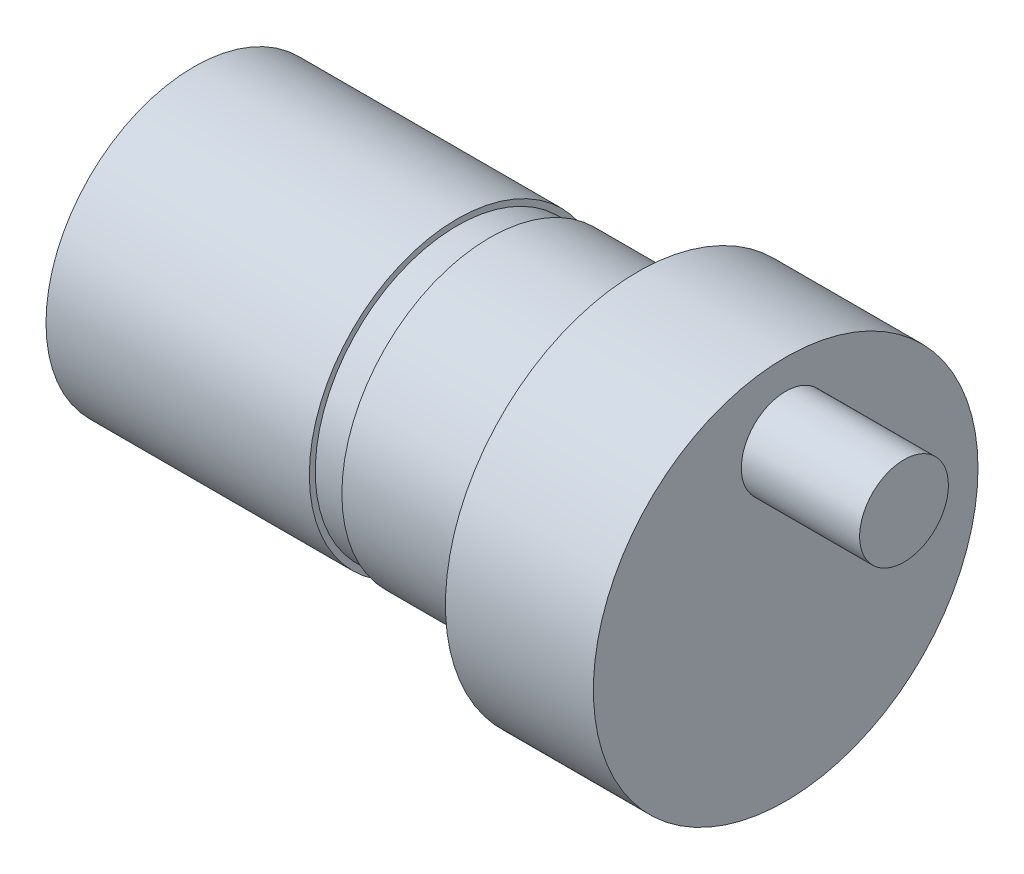
ISO-10303-21;
HEADER;
FILE_DESCRIPTION(('STEP AP214'),'2;1');
FILE_NAME('part.step','',(''),(''),'','','');
FILE_SCHEMA(('AUTOMOTIVE_DESIGN { 1 0 10303 214 1 1 1 1 }'));
ENDSEC;
DATA;
#1=APPLICATION_CONTEXT('core data for automotive mechanical design processes');
#2=APPLICATION_PROTOCOL_DEFINITION('international standard','automotive_design',2000,#1);
#3=PRODUCT_CONTEXT('',#1,'mechanical');
#4=PRODUCT('Part','Part','',(#3));
#5=PRODUCT_RELATED_PRODUCT_CATEGORY('part','',(#4));
#6=PRODUCT_DEFINITION_FORMATION('','',#4);
#7=PRODUCT_DEFINITION_CONTEXT('part definition',#1,'design');
#8=PRODUCT_DEFINITION('design','',#6,#7);
#9=PRODUCT_DEFINITION_SHAPE('','',#8);
#10=(LENGTH_UNIT() NAMED_UNIT(*) SI_UNIT(.MILLI.,.METRE.));
#11=(NAMED_UNIT(*) PLANE_ANGLE_UNIT() SI_UNIT($,.RADIAN.));
#12=(NAMED_UNIT(*) SI_UNIT($,.STERADIAN.) SOLID_ANGLE_UNIT());
#13=UNCERTAINTY_MEASURE_WITH_UNIT(LENGTH_MEASURE(1.E-05),#10,'distance_accuracy_value','');
#14=(GEOMETRIC_REPRESENTATION_CONTEXT(3) GLOBAL_UNCERTAINTY_ASSIGNED_CONTEXT((#13)) GLOBAL_UNIT_ASSIGNED_CONTEXT((#10,
#11,#12)) REPRESENTATION_CONTEXT('',''));
#15=CARTESIAN_POINT('',(0.,0.,0.));
#16=DIRECTION('',(0.,0.,1.));
#17=DIRECTION('',(1.,0.,0.));
#18=AXIS2_PLACEMENT_3D('',#15,#16,#17);
#19=CARTESIAN_POINT('',(-15.,0.,0.));
#20=DIRECTION('',(1.,0.,0.));
#21=DIRECTION('',(0.,0.,-1.));
#22=AXIS2_PLACEMENT_3D('',#19,#20,#21);
#23=CYLINDRICAL_SURFACE('',#22,5.);
#24=CARTESIAN_POINT('',(0.,0.,0.));
#25=DIRECTION('',(-1.,0.,0.));
#26=DIRECTION('',(0.,0.,1.));
#27=AXIS2_PLACEMENT_3D('',#24,#25,#26);
#28=CIRCLE('',#27,5.);
#29=CARTESIAN_POINT('',(0.,0.,5.));
#30=VERTEX_POINT('',#29);
#31=EDGE_CURVE('E10',#30,#30,#28,.T.);
#32=ORIENTED_EDGE('',*,*,#31,.T.);
#33=EDGE_LOOP('',(#32));
#34=FACE_BOUND('',#33,.T.);
#35=CARTESIAN_POINT('',(-5.,0.,0.));
#36=DIRECTION('',(1.,0.,0.));
#37=DIRECTION('',(0.,0.,-1.));
#38=AXIS2_PLACEMENT_3D('',#35,#36,#37);
#39=CIRCLE('',#38,5.);
#40=CARTESIAN_POINT('',(-5.,0.,-5.));
#41=VERTEX_POINT('',#40);
#42=EDGE_CURVE('E83',#41,#41,#39,.T.);
#43=ORIENTED_EDGE('',*,*,#42,.T.);
#44=EDGE_LOOP('',(#43));
#45=FACE_BOUND('',#44,.T.);
#46=ADVANCED_FACE('F43',(#34,#45),#23,.T.);
#47=CARTESIAN_POINT('',(5.,0.,0.));
#48=DIRECTION('',(-1.,0.,0.));
#49=DIRECTION('',(0.,0.,1.));
#50=AXIS2_PLACEMENT_3D('',#47,#48,#49);
#51=CYLINDRICAL_SURFACE('',#50,6.5);
#52=CARTESIAN_POINT('',(5.,0.,0.));
#53=DIRECTION('',(1.,0.,0.));
#54=DIRECTION('',(0.,0.,-1.));
#55=AXIS2_PLACEMENT_3D('',#52,#53,#54);
#56=CIRCLE('',#55,6.5);
#57=CARTESIAN_POINT('',(5.,0.,-6.5));
#58=VERTEX_POINT('',#57);
#59=EDGE_CURVE('E52',#58,#58,#56,.T.);
#60=ORIENTED_EDGE('',*,*,#59,.F.);
#61=EDGE_LOOP('',(#60));
#62=FACE_BOUND('',#61,.T.);
#63=CARTESIAN_POINT('',(0.,0.,0.));
#64=DIRECTION('',(1.,0.,0.));
#65=DIRECTION('',(0.,0.,-1.));
#66=AXIS2_PLACEMENT_3D('',#63,#64,#65);
#67=CIRCLE('',#66,6.5);
#68=CARTESIAN_POINT('',(0.,0.,-6.5));
#69=VERTEX_POINT('',#68);
#70=EDGE_CURVE('E47',#69,#69,#67,.T.);
#71=ORIENTED_EDGE('',*,*,#70,.T.);
#72=EDGE_LOOP('',(#71));
#73=FACE_BOUND('',#72,.T.);
#74=ADVANCED_FACE('F45',(#62,#73),#51,.T.);
#75=CARTESIAN_POINT('',(5.,0.,0.));
#76=DIRECTION('',(1.,0.,0.));
#77=DIRECTION('',(0.,0.,-1.));
#78=AXIS2_PLACEMENT_3D('',#75,#76,#77);
#79=PLANE('',#78);
#80=CARTESIAN_POINT('',(5.,4.,0.));
#81=DIRECTION('',(1.,0.,0.));
#82=DIRECTION('',(0.,0.,-1.));
#83=AXIS2_PLACEMENT_3D('',#80,#81,#82);
#84=CIRCLE('',#83,1.5);
#85=CARTESIAN_POINT('',(5.,4.,-1.5));
#86=VERTEX_POINT('',#85);
#87=EDGE_CURVE('E64',#86,#86,#84,.T.);
#88=ORIENTED_EDGE('',*,*,#87,.F.);
#89=EDGE_LOOP('',(#88));
#90=FACE_BOUND('',#89,.T.);
#91=ORIENTED_EDGE('',*,*,#59,.T.);
#92=EDGE_LOOP('',(#91));
#93=FACE_BOUND('',#92,.T.);
#94=ADVANCED_FACE('F111',(#90,#93),#79,.T.);
#95=CARTESIAN_POINT('',(0.,0.,0.));
#96=DIRECTION('',(1.,0.,0.));
#97=DIRECTION('',(0.,0.,-1.));
#98=AXIS2_PLACEMENT_3D('',#95,#96,#97);
#99=PLANE('',#98);
#100=ORIENTED_EDGE('',*,*,#31,.F.);
#101=EDGE_LOOP('',(#100));
#102=FACE_BOUND('',#101,.T.);
#103=ORIENTED_EDGE('',*,*,#70,.F.);
#104=EDGE_LOOP('',(#103));
#105=FACE_BOUND('',#104,.T.);
#106=ADVANCED_FACE('F167',(#102,#105),#99,.F.);
#107=CARTESIAN_POINT('',(9.,4.,0.));
#108=DIRECTION('',(-1.,0.,0.));
#109=DIRECTION('',(0.,0.,1.));
#110=AXIS2_PLACEMENT_3D('',#107,#108,#109);
#111=CYLINDRICAL_SURFACE('',#110,1.5);
#112=CARTESIAN_POINT('',(9.,4.,0.));
#113=DIRECTION('',(1.,0.,0.));
#114=DIRECTION('',(0.,0.,-1.));
#115=AXIS2_PLACEMENT_3D('',#112,#113,#114);
#116=CIRCLE('',#115,1.5);
#117=CARTESIAN_POINT('',(9.,4.,-1.5));
#118=VERTEX_POINT('',#117);
#119=EDGE_CURVE('E63',#118,#118,#116,.T.);
#120=ORIENTED_EDGE('',*,*,#119,.F.);
#121=EDGE_LOOP('',(#120));
#122=FACE_BOUND('',#121,.T.);
#123=ORIENTED_EDGE('',*,*,#87,.T.);
#124=EDGE_LOOP('',(#123));
#125=FACE_BOUND('',#124,.T.);
#126=ADVANCED_FACE('F103',(#122,#125),#111,.T.);
#127=CARTESIAN_POINT('',(9.,4.,0.));
#128=DIRECTION('',(1.,0.,0.));
#129=DIRECTION('',(0.,0.,-1.));
#130=AXIS2_PLACEMENT_3D('',#127,#128,#129);
#131=PLANE('',#130);
#132=ORIENTED_EDGE('',*,*,#119,.T.);
#133=EDGE_LOOP('',(#132));
#134=FACE_BOUND('',#133,.T.);
#135=ADVANCED_FACE('F92',(#134),#131,.T.);
#136=CARTESIAN_POINT('',(-5.,5.,0.));
#137=DIRECTION('',(-1.,0.,0.));
#138=DIRECTION('',(0.,0.,1.));
#139=AXIS2_PLACEMENT_3D('',#136,#137,#138);
#140=PLANE('',#139);
#141=CARTESIAN_POINT('',(-5.,0.,0.));
#142=DIRECTION('',(1.,0.,0.));
#143=DIRECTION('',(0.,0.,-1.));
#144=AXIS2_PLACEMENT_3D('',#141,#142,#143);
#145=CIRCLE('',#144,4.8);
#146=CARTESIAN_POINT('',(-5.,0.,-4.8));
#147=VERTEX_POINT('',#146);
#148=EDGE_CURVE('E68',#147,#147,#145,.T.);
#149=ORIENTED_EDGE('',*,*,#148,.T.);
#150=EDGE_LOOP('',(#149));
#151=FACE_BOUND('',#150,.T.);
#152=ORIENTED_EDGE('',*,*,#42,.F.);
#153=EDGE_LOOP('',(#152));
#154=FACE_BOUND('',#153,.T.);
#155=ADVANCED_FACE('F89',(#151,#154),#140,.T.);
#156=CARTESIAN_POINT('',(-1.17847048189077,0.,0.));
#157=DIRECTION('',(1.,0.,0.));
#158=DIRECTION('',(0.,0.,-1.));
#159=AXIS2_PLACEMENT_3D('',#156,#157,#158);
#160=CYLINDRICAL_SURFACE('',#159,4.8);
#161=CARTESIAN_POINT('',(-6.1,0.,0.));
#162=DIRECTION('',(1.,0.,0.));
#163=DIRECTION('',(0.,0.,-1.));
#164=AXIS2_PLACEMENT_3D('',#161,#162,#163);
#165=CIRCLE('',#164,4.8);
#166=CARTESIAN_POINT('',(-6.1,0.,-4.8));
#167=VERTEX_POINT('',#166);
#168=EDGE_CURVE('E75',#167,#167,#165,.T.);
#169=ORIENTED_EDGE('',*,*,#168,.T.);
#170=EDGE_LOOP('',(#169));
#171=FACE_BOUND('',#170,.T.);
#172=ORIENTED_EDGE('',*,*,#148,.F.);
#173=EDGE_LOOP('',(#172));
#174=FACE_BOUND('',#173,.T.);
#175=ADVANCED_FACE('F91',(#171,#174),#160,.T.);
#176=CARTESIAN_POINT('',(-6.1,4.8,0.));
#177=DIRECTION('',(1.,0.,0.));
#178=DIRECTION('',(0.,0.,-1.));
#179=AXIS2_PLACEMENT_3D('',#176,#177,#178);
#180=PLANE('',#179);
#181=CARTESIAN_POINT('',(-6.1,0.,0.));
#182=DIRECTION('',(1.,0.,0.));
#183=DIRECTION('',(0.,0.,-1.));
#184=AXIS2_PLACEMENT_3D('',#181,#182,#183);
#185=CIRCLE('',#184,5.);
#186=CARTESIAN_POINT('',(-6.1,0.,-5.));
#187=VERTEX_POINT('',#186);
#188=EDGE_CURVE('E79',#187,#187,#185,.T.);
#189=ORIENTED_EDGE('',*,*,#188,.T.);
#190=EDGE_LOOP('',(#189));
#191=FACE_BOUND('',#190,.T.);
#192=ORIENTED_EDGE('',*,*,#168,.F.);
#193=EDGE_LOOP('',(#192));
#194=FACE_BOUND('',#193,.T.);
#195=ADVANCED_FACE('F99',(#191,#194),#180,.T.);
#196=CARTESIAN_POINT('',(-15.,0.,0.));
#197=DIRECTION('',(-1.,0.,0.));
#198=DIRECTION('',(0.,0.,1.));
#199=AXIS2_PLACEMENT_3D('',#196,#197,#198);
#200=PLANE('',#199);
#201=CARTESIAN_POINT('',(-15.,0.,0.));
#202=DIRECTION('',(-1.,0.,0.));
#203=DIRECTION('',(0.,0.,1.));
#204=AXIS2_PLACEMENT_3D('',#201,#202,#203);
#205=CIRCLE('',#204,5.);
#206=CARTESIAN_POINT('',(-15.,0.,5.));
#207=VERTEX_POINT('',#206);
#208=EDGE_CURVE('E59',#207,#207,#205,.T.);
#209=ORIENTED_EDGE('',*,*,#208,.T.);
#210=EDGE_LOOP('',(#209));
#211=FACE_BOUND('',#210,.T.);
#212=ADVANCED_FACE('F116',(#211),#200,.T.);
#213=ORIENTED_EDGE('',*,*,#208,.F.);
#214=EDGE_LOOP('',(#213));
#215=FACE_BOUND('',#214,.T.);
#216=ORIENTED_EDGE('',*,*,#188,.F.);
#217=EDGE_LOOP('',(#216));
#218=FACE_BOUND('',#217,.T.);
#219=ADVANCED_FACE('F107',(#215,#218),#23,.T.);
#220=CLOSED_SHELL('',(#46,#74,#94,#106,#126,#135,#155,#175,#195,#212,#219));
#221=MANIFOLD_SOLID_BREP('B2',#220);
#222=ADVANCED_BREP_SHAPE_REPRESENTATION('',(#18,#221),#14);
#223=SHAPE_DEFINITION_REPRESENTATION(#9,#222);
ENDSEC;
END-ISO-10303-21;
